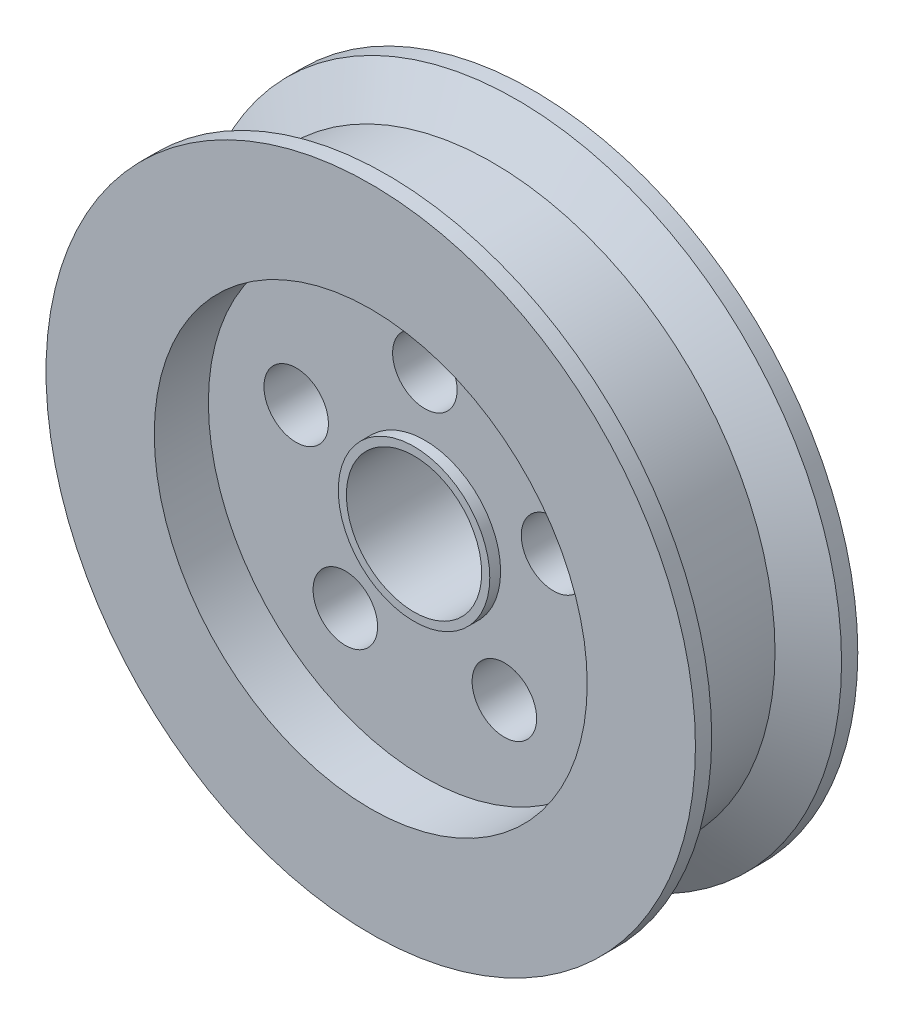
ISO-10303-21;
HEADER;
FILE_DESCRIPTION(('STEP AP214'),'2;1');
FILE_NAME('part.step','',(''),(''),'','','');
FILE_SCHEMA(('AUTOMOTIVE_DESIGN { 1 0 10303 214 1 1 1 1 }'));
ENDSEC;
DATA;
#1=APPLICATION_CONTEXT('core data for automotive mechanical design processes');
#2=APPLICATION_PROTOCOL_DEFINITION('international standard','automotive_design',2000,#1);
#3=PRODUCT_CONTEXT('',#1,'mechanical');
#4=PRODUCT('Part','Part','',(#3));
#5=PRODUCT_RELATED_PRODUCT_CATEGORY('part','',(#4));
#6=PRODUCT_DEFINITION_FORMATION('','',#4);
#7=PRODUCT_DEFINITION_CONTEXT('part definition',#1,'design');
#8=PRODUCT_DEFINITION('design','',#6,#7);
#9=PRODUCT_DEFINITION_SHAPE('','',#8);
#10=(LENGTH_UNIT() NAMED_UNIT(*) SI_UNIT(.MILLI.,.METRE.));
#11=(NAMED_UNIT(*) PLANE_ANGLE_UNIT() SI_UNIT($,.RADIAN.));
#12=(NAMED_UNIT(*) SI_UNIT($,.STERADIAN.) SOLID_ANGLE_UNIT());
#13=UNCERTAINTY_MEASURE_WITH_UNIT(LENGTH_MEASURE(1.E-05),#10,'distance_accuracy_value','');
#14=(GEOMETRIC_REPRESENTATION_CONTEXT(3) GLOBAL_UNCERTAINTY_ASSIGNED_CONTEXT((#13)) GLOBAL_UNIT_ASSIGNED_CONTEXT((#10,
#11,#12)) REPRESENTATION_CONTEXT('',''));
#15=CARTESIAN_POINT('',(0.,0.,0.));
#16=DIRECTION('',(0.,0.,1.));
#17=DIRECTION('',(1.,0.,0.));
#18=AXIS2_PLACEMENT_3D('',#15,#16,#17);
#19=CARTESIAN_POINT('',(0.,0.,30.));
#20=DIRECTION('',(0.,0.,-1.));
#21=DIRECTION('',(-1.,0.,0.));
#22=AXIS2_PLACEMENT_3D('',#19,#20,#21);
#23=CYLINDRICAL_SURFACE('',#22,60.);
#24=CARTESIAN_POINT('',(0.,0.,3.));
#25=DIRECTION('',(0.,0.,1.));
#26=DIRECTION('',(1.,0.,0.));
#27=AXIS2_PLACEMENT_3D('',#24,#25,#26);
#28=CIRCLE('',#27,60.);
#29=CARTESIAN_POINT('',(60.,0.,3.));
#30=VERTEX_POINT('',#29);
#31=EDGE_CURVE('E70',#30,#30,#28,.T.);
#32=ORIENTED_EDGE('',*,*,#31,.F.);
#33=EDGE_LOOP('',(#32));
#34=FACE_BOUND('',#33,.T.);
#35=CARTESIAN_POINT('',(0.,0.,0.));
#36=DIRECTION('',(0.,0.,1.));
#37=DIRECTION('',(1.,0.,0.));
#38=AXIS2_PLACEMENT_3D('',#35,#36,#37);
#39=CIRCLE('',#38,60.);
#40=CARTESIAN_POINT('',(60.,0.,0.));
#41=VERTEX_POINT('',#40);
#42=EDGE_CURVE('E50',#41,#41,#39,.T.);
#43=ORIENTED_EDGE('',*,*,#42,.T.);
#44=EDGE_LOOP('',(#43));
#45=FACE_BOUND('',#44,.T.);
#46=ADVANCED_FACE('F39',(#34,#45),#23,.T.);
#47=CARTESIAN_POINT('',(0.,0.,30.));
#48=DIRECTION('',(0.,0.,-1.));
#49=DIRECTION('',(-1.,0.,0.));
#50=AXIS2_PLACEMENT_3D('',#47,#48,#49);
#51=CYLINDRICAL_SURFACE('',#50,12.5);
#52=CARTESIAN_POINT('',(0.,0.,22.));
#53=DIRECTION('',(0.,0.,1.));
#54=DIRECTION('',(1.,0.,0.));
#55=AXIS2_PLACEMENT_3D('',#52,#53,#54);
#56=CIRCLE('',#55,12.5);
#57=CARTESIAN_POINT('',(12.5,0.,22.));
#58=VERTEX_POINT('',#57);
#59=EDGE_CURVE('E110',#58,#58,#56,.F.);
#60=ORIENTED_EDGE('',*,*,#59,.F.);
#61=EDGE_LOOP('',(#60));
#62=FACE_BOUND('',#61,.T.);
#63=CARTESIAN_POINT('',(0.,0.,0.));
#64=DIRECTION('',(0.,0.,1.));
#65=DIRECTION('',(1.,0.,0.));
#66=AXIS2_PLACEMENT_3D('',#63,#64,#65);
#67=CIRCLE('',#66,12.5);
#68=CARTESIAN_POINT('',(12.5,0.,0.));
#69=VERTEX_POINT('',#68);
#70=EDGE_CURVE('E55',#69,#69,#67,.T.);
#71=ORIENTED_EDGE('',*,*,#70,.F.);
#72=EDGE_LOOP('',(#71));
#73=FACE_BOUND('',#72,.T.);
#74=ADVANCED_FACE('F117',(#62,#73),#51,.F.);
#75=CARTESIAN_POINT('',(0.,0.,30.));
#76=DIRECTION('',(0.,0.,1.));
#77=DIRECTION('',(1.,0.,0.));
#78=AXIS2_PLACEMENT_3D('',#75,#76,#77);
#79=PLANE('',#78);
#80=CARTESIAN_POINT('',(0.,0.,30.));
#81=DIRECTION('',(0.,0.,1.));
#82=DIRECTION('',(1.,0.,0.));
#83=AXIS2_PLACEMENT_3D('',#80,#81,#82);
#84=CIRCLE('',#83,40.);
#85=CARTESIAN_POINT('',(40.,0.,30.));
#86=VERTEX_POINT('',#85);
#87=EDGE_CURVE('E60',#86,#86,#84,.T.);
#88=ORIENTED_EDGE('',*,*,#87,.F.);
#89=EDGE_LOOP('',(#88));
#90=FACE_BOUND('',#89,.T.);
#91=CARTESIAN_POINT('',(0.,0.,30.));
#92=DIRECTION('',(0.,0.,1.));
#93=DIRECTION('',(1.,0.,0.));
#94=AXIS2_PLACEMENT_3D('',#91,#92,#93);
#95=CIRCLE('',#94,60.);
#96=CARTESIAN_POINT('',(60.,0.,30.));
#97=VERTEX_POINT('',#96);
#98=EDGE_CURVE('E46',#97,#97,#95,.T.);
#99=ORIENTED_EDGE('',*,*,#98,.T.);
#100=EDGE_LOOP('',(#99));
#101=FACE_BOUND('',#100,.T.);
#102=ADVANCED_FACE('F120',(#90,#101),#79,.T.);
#103=CARTESIAN_POINT('',(0.,0.,0.));
#104=DIRECTION('',(0.,0.,1.));
#105=DIRECTION('',(1.,0.,0.));
#106=AXIS2_PLACEMENT_3D('',#103,#104,#105);
#107=PLANE('',#106);
#108=CARTESIAN_POINT('',(0.,25.,0.));
#109=DIRECTION('',(0.,0.,1.));
#110=DIRECTION('',(1.,0.,0.));
#111=AXIS2_PLACEMENT_3D('',#108,#109,#110);
#112=CIRCLE('',#111,5.95909830276263);
#113=CARTESIAN_POINT('',(5.95909830276263,25.,0.));
#114=VERTEX_POINT('',#113);
#115=EDGE_CURVE('E63',#114,#114,#112,.T.);
#116=ORIENTED_EDGE('',*,*,#115,.T.);
#117=EDGE_LOOP('',(#116));
#118=FACE_BOUND('',#117,.T.);
#119=CARTESIAN_POINT('',(23.7764129073796,7.7254248593747,0.));
#120=DIRECTION('',(0.,0.,1.));
#121=DIRECTION('',(1.,0.,0.));
#122=AXIS2_PLACEMENT_3D('',#119,#120,#121);
#123=CIRCLE('',#122,5.95909830276311);
#124=CARTESIAN_POINT('',(29.7355112101427,7.7254248593747,0.));
#125=VERTEX_POINT('',#124);
#126=EDGE_CURVE('E88',#125,#125,#123,.T.);
#127=ORIENTED_EDGE('',*,*,#126,.T.);
#128=EDGE_LOOP('',(#127));
#129=FACE_BOUND('',#128,.T.);
#130=CARTESIAN_POINT('',(14.6946313073137,-20.2254248593731,0.));
#131=DIRECTION('',(0.,0.,1.));
#132=DIRECTION('',(1.,0.,0.));
#133=AXIS2_PLACEMENT_3D('',#130,#131,#132);
#134=CIRCLE('',#133,5.95909830276442);
#135=CARTESIAN_POINT('',(20.6537296100782,-20.2254248593731,0.));
#136=VERTEX_POINT('',#135);
#137=EDGE_CURVE('E82',#136,#136,#134,.T.);
#138=ORIENTED_EDGE('',*,*,#137,.T.);
#139=EDGE_LOOP('',(#138));
#140=FACE_BOUND('',#139,.T.);
#141=CARTESIAN_POINT('',(-14.6946313073099,-20.2254248593743,0.));
#142=DIRECTION('',(0.,0.,1.));
#143=DIRECTION('',(1.,0.,0.));
#144=AXIS2_PLACEMENT_3D('',#141,#142,#143);
#145=CIRCLE('',#144,5.95909830276486);
#146=CARTESIAN_POINT('',(-8.73553300454505,-20.2254248593743,0.));
#147=VERTEX_POINT('',#146);
#148=EDGE_CURVE('E76',#147,#147,#145,.T.);
#149=ORIENTED_EDGE('',*,*,#148,.T.);
#150=EDGE_LOOP('',(#149));
#151=FACE_BOUND('',#150,.T.);
#152=CARTESIAN_POINT('',(-23.7764129073781,7.72542485937267,0.));
#153=DIRECTION('',(0.,0.,1.));
#154=DIRECTION('',(1.,0.,0.));
#155=AXIS2_PLACEMENT_3D('',#152,#153,#154);
#156=CIRCLE('',#155,5.95909830276391);
#157=CARTESIAN_POINT('',(-17.8173146046142,7.72542485937267,0.));
#158=VERTEX_POINT('',#157);
#159=EDGE_CURVE('E69',#158,#158,#156,.T.);
#160=ORIENTED_EDGE('',*,*,#159,.T.);
#161=EDGE_LOOP('',(#160));
#162=FACE_BOUND('',#161,.T.);
#163=ORIENTED_EDGE('',*,*,#42,.F.);
#164=EDGE_LOOP('',(#163));
#165=FACE_BOUND('',#164,.T.);
#166=ORIENTED_EDGE('',*,*,#70,.T.);
#167=EDGE_LOOP('',(#166));
#168=FACE_BOUND('',#167,.T.);
#169=ADVANCED_FACE('F124',(#118,#129,#140,#151,#162,#165,#168),#107,.F.);
#170=CARTESIAN_POINT('',(0.,0.,27.));
#171=DIRECTION('',(0.,0.,1.));
#172=DIRECTION('',(1.,0.,0.));
#173=AXIS2_PLACEMENT_3D('',#170,#171,#172);
#174=CIRCLE('',#173,60.);
#175=CARTESIAN_POINT('',(60.,0.,27.));
#176=VERTEX_POINT('',#175);
#177=EDGE_CURVE('E104',#176,#176,#174,.T.);
#178=ORIENTED_EDGE('',*,*,#177,.T.);
#179=EDGE_LOOP('',(#178));
#180=FACE_BOUND('',#179,.T.);
#181=ORIENTED_EDGE('',*,*,#98,.F.);
#182=EDGE_LOOP('',(#181));
#183=FACE_BOUND('',#182,.T.);
#184=ADVANCED_FACE('F41',(#180,#183),#23,.T.);
#185=CARTESIAN_POINT('',(0.,0.,20.));
#186=DIRECTION('',(0.,0.,1.));
#187=DIRECTION('',(1.,0.,0.));
#188=AXIS2_PLACEMENT_3D('',#185,#186,#187);
#189=CYLINDRICAL_SURFACE('',#188,40.);
#190=CARTESIAN_POINT('',(0.,0.,20.));
#191=DIRECTION('',(0.,0.,1.));
#192=DIRECTION('',(1.,0.,0.));
#193=AXIS2_PLACEMENT_3D('',#190,#191,#192);
#194=CIRCLE('',#193,40.);
#195=CARTESIAN_POINT('',(40.,0.,20.));
#196=VERTEX_POINT('',#195);
#197=EDGE_CURVE('E59',#196,#196,#194,.T.);
#198=ORIENTED_EDGE('',*,*,#197,.F.);
#199=EDGE_LOOP('',(#198));
#200=FACE_BOUND('',#199,.T.);
#201=ORIENTED_EDGE('',*,*,#87,.T.);
#202=EDGE_LOOP('',(#201));
#203=FACE_BOUND('',#202,.T.);
#204=ADVANCED_FACE('F131',(#200,#203),#189,.F.);
#205=CARTESIAN_POINT('',(0.,0.,20.));
#206=DIRECTION('',(0.,0.,1.));
#207=DIRECTION('',(1.,0.,0.));
#208=AXIS2_PLACEMENT_3D('',#205,#206,#207);
#209=PLANE('',#208);
#210=CARTESIAN_POINT('',(0.,0.,20.));
#211=DIRECTION('',(0.,0.,1.));
#212=DIRECTION('',(1.,0.,0.));
#213=AXIS2_PLACEMENT_3D('',#210,#211,#212);
#214=CIRCLE('',#213,14.);
#215=CARTESIAN_POINT('',(14.,0.,20.));
#216=VERTEX_POINT('',#215);
#217=EDGE_CURVE('E10',#216,#216,#214,.T.);
#218=ORIENTED_EDGE('',*,*,#217,.F.);
#219=EDGE_LOOP('',(#218));
#220=FACE_BOUND('',#219,.T.);
#221=CARTESIAN_POINT('',(0.,25.,20.));
#222=DIRECTION('',(0.,0.,1.));
#223=DIRECTION('',(1.,0.,0.));
#224=AXIS2_PLACEMENT_3D('',#221,#222,#223);
#225=CIRCLE('',#224,5.95909830276263);
#226=CARTESIAN_POINT('',(5.95909830276263,25.,20.));
#227=VERTEX_POINT('',#226);
#228=EDGE_CURVE('E91',#227,#227,#225,.T.);
#229=ORIENTED_EDGE('',*,*,#228,.F.);
#230=EDGE_LOOP('',(#229));
#231=FACE_BOUND('',#230,.T.);
#232=CARTESIAN_POINT('',(23.7764129073796,7.7254248593747,20.));
#233=DIRECTION('',(0.,0.,1.));
#234=DIRECTION('',(1.,0.,0.));
#235=AXIS2_PLACEMENT_3D('',#232,#233,#234);
#236=CIRCLE('',#235,5.95909830276311);
#237=CARTESIAN_POINT('',(29.7355112101427,7.7254248593747,20.));
#238=VERTEX_POINT('',#237);
#239=EDGE_CURVE('E85',#238,#238,#236,.T.);
#240=ORIENTED_EDGE('',*,*,#239,.F.);
#241=EDGE_LOOP('',(#240));
#242=FACE_BOUND('',#241,.T.);
#243=CARTESIAN_POINT('',(14.6946313073137,-20.2254248593731,20.));
#244=DIRECTION('',(0.,0.,1.));
#245=DIRECTION('',(1.,0.,0.));
#246=AXIS2_PLACEMENT_3D('',#243,#244,#245);
#247=CIRCLE('',#246,5.95909830276442);
#248=CARTESIAN_POINT('',(20.6537296100782,-20.2254248593731,20.));
#249=VERTEX_POINT('',#248);
#250=EDGE_CURVE('E79',#249,#249,#247,.T.);
#251=ORIENTED_EDGE('',*,*,#250,.F.);
#252=EDGE_LOOP('',(#251));
#253=FACE_BOUND('',#252,.T.);
#254=CARTESIAN_POINT('',(-14.6946313073099,-20.2254248593743,20.));
#255=DIRECTION('',(0.,0.,1.));
#256=DIRECTION('',(1.,0.,0.));
#257=AXIS2_PLACEMENT_3D('',#254,#255,#256);
#258=CIRCLE('',#257,5.95909830276486);
#259=CARTESIAN_POINT('',(-8.73553300454505,-20.2254248593743,20.));
#260=VERTEX_POINT('',#259);
#261=EDGE_CURVE('E73',#260,#260,#258,.T.);
#262=ORIENTED_EDGE('',*,*,#261,.F.);
#263=EDGE_LOOP('',(#262));
#264=FACE_BOUND('',#263,.T.);
#265=CARTESIAN_POINT('',(-23.7764129073781,7.72542485937267,20.));
#266=DIRECTION('',(0.,0.,1.));
#267=DIRECTION('',(1.,0.,0.));
#268=AXIS2_PLACEMENT_3D('',#265,#266,#267);
#269=CIRCLE('',#268,5.95909830276391);
#270=CARTESIAN_POINT('',(-17.8173146046142,7.72542485937267,20.));
#271=VERTEX_POINT('',#270);
#272=EDGE_CURVE('E66',#271,#271,#269,.T.);
#273=ORIENTED_EDGE('',*,*,#272,.F.);
#274=EDGE_LOOP('',(#273));
#275=FACE_BOUND('',#274,.T.);
#276=ORIENTED_EDGE('',*,*,#197,.T.);
#277=EDGE_LOOP('',(#276));
#278=FACE_BOUND('',#277,.T.);
#279=ADVANCED_FACE('F178',(#220,#231,#242,#253,#264,#275,#278),#209,.T.);
#280=CARTESIAN_POINT('',(-23.7764129073781,7.72542485937267,0.));
#281=DIRECTION('',(0.,0.,1.));
#282=DIRECTION('',(1.,0.,0.));
#283=AXIS2_PLACEMENT_3D('',#280,#281,#282);
#284=CYLINDRICAL_SURFACE('',#283,5.95909830276391);
#285=ORIENTED_EDGE('',*,*,#159,.F.);
#286=EDGE_LOOP('',(#285));
#287=FACE_BOUND('',#286,.T.);
#288=ORIENTED_EDGE('',*,*,#272,.T.);
#289=EDGE_LOOP('',(#288));
#290=FACE_BOUND('',#289,.T.);
#291=ADVANCED_FACE('F174',(#287,#290),#284,.F.);
#292=CARTESIAN_POINT('',(-14.6946313073099,-20.2254248593743,0.));
#293=DIRECTION('',(0.,0.,1.));
#294=DIRECTION('',(1.,0.,0.));
#295=AXIS2_PLACEMENT_3D('',#292,#293,#294);
#296=CYLINDRICAL_SURFACE('',#295,5.95909830276486);
#297=ORIENTED_EDGE('',*,*,#148,.F.);
#298=EDGE_LOOP('',(#297));
#299=FACE_BOUND('',#298,.T.);
#300=ORIENTED_EDGE('',*,*,#261,.T.);
#301=EDGE_LOOP('',(#300));
#302=FACE_BOUND('',#301,.T.);
#303=ADVANCED_FACE('F170',(#299,#302),#296,.F.);
#304=CARTESIAN_POINT('',(14.6946313073137,-20.2254248593731,0.));
#305=DIRECTION('',(0.,0.,1.));
#306=DIRECTION('',(1.,0.,0.));
#307=AXIS2_PLACEMENT_3D('',#304,#305,#306);
#308=CYLINDRICAL_SURFACE('',#307,5.95909830276442);
#309=ORIENTED_EDGE('',*,*,#137,.F.);
#310=EDGE_LOOP('',(#309));
#311=FACE_BOUND('',#310,.T.);
#312=ORIENTED_EDGE('',*,*,#250,.T.);
#313=EDGE_LOOP('',(#312));
#314=FACE_BOUND('',#313,.T.);
#315=ADVANCED_FACE('F166',(#311,#314),#308,.F.);
#316=CARTESIAN_POINT('',(23.7764129073796,7.7254248593747,0.));
#317=DIRECTION('',(0.,0.,1.));
#318=DIRECTION('',(1.,0.,0.));
#319=AXIS2_PLACEMENT_3D('',#316,#317,#318);
#320=CYLINDRICAL_SURFACE('',#319,5.95909830276311);
#321=ORIENTED_EDGE('',*,*,#126,.F.);
#322=EDGE_LOOP('',(#321));
#323=FACE_BOUND('',#322,.T.);
#324=ORIENTED_EDGE('',*,*,#239,.T.);
#325=EDGE_LOOP('',(#324));
#326=FACE_BOUND('',#325,.T.);
#327=ADVANCED_FACE('F158',(#323,#326),#320,.F.);
#328=CARTESIAN_POINT('',(0.,25.,0.));
#329=DIRECTION('',(0.,0.,1.));
#330=DIRECTION('',(1.,0.,0.));
#331=AXIS2_PLACEMENT_3D('',#328,#329,#330);
#332=CYLINDRICAL_SURFACE('',#331,5.95909830276263);
#333=ORIENTED_EDGE('',*,*,#115,.F.);
#334=EDGE_LOOP('',(#333));
#335=FACE_BOUND('',#334,.T.);
#336=ORIENTED_EDGE('',*,*,#228,.T.);
#337=EDGE_LOOP('',(#336));
#338=FACE_BOUND('',#337,.T.);
#339=ADVANCED_FACE('F148',(#335,#338),#332,.F.);
#340=CARTESIAN_POINT('',(0.,0.,3.));
#341=DIRECTION('',(0.,0.,-1.));
#342=DIRECTION('',(-1.,0.,0.));
#343=AXIS2_PLACEMENT_3D('',#340,#341,#342);
#344=CONICAL_SURFACE('',#343,60.,1.04719755119659);
#345=CARTESIAN_POINT('',(0.,0.,7.5));
#346=DIRECTION('',(0.,0.,1.));
#347=DIRECTION('',(1.,0.,0.));
#348=AXIS2_PLACEMENT_3D('',#345,#346,#347);
#349=CIRCLE('',#348,52.2057713659401);
#350=CARTESIAN_POINT('',(52.2057713659401,0.,7.5));
#351=VERTEX_POINT('',#350);
#352=EDGE_CURVE('E98',#351,#351,#349,.T.);
#353=ORIENTED_EDGE('',*,*,#352,.F.);
#354=EDGE_LOOP('',(#353));
#355=FACE_BOUND('',#354,.T.);
#356=ORIENTED_EDGE('',*,*,#31,.T.);
#357=EDGE_LOOP('',(#356));
#358=FACE_BOUND('',#357,.T.);
#359=ADVANCED_FACE('F145',(#355,#358),#344,.T.);
#360=CARTESIAN_POINT('',(0.,0.,0.));
#361=DIRECTION('',(0.,0.,1.));
#362=DIRECTION('',(1.,0.,0.));
#363=AXIS2_PLACEMENT_3D('',#360,#361,#362);
#364=CYLINDRICAL_SURFACE('',#363,52.2057713659402);
#365=CARTESIAN_POINT('',(0.,0.,22.5));
#366=DIRECTION('',(0.,0.,1.));
#367=DIRECTION('',(1.,0.,0.));
#368=AXIS2_PLACEMENT_3D('',#365,#366,#367);
#369=CIRCLE('',#368,52.2057713659402);
#370=CARTESIAN_POINT('',(52.2057713659402,0.,22.5));
#371=VERTEX_POINT('',#370);
#372=EDGE_CURVE('E101',#371,#371,#369,.T.);
#373=ORIENTED_EDGE('',*,*,#372,.F.);
#374=EDGE_LOOP('',(#373));
#375=FACE_BOUND('',#374,.T.);
#376=ORIENTED_EDGE('',*,*,#352,.T.);
#377=EDGE_LOOP('',(#376));
#378=FACE_BOUND('',#377,.T.);
#379=ADVANCED_FACE('F147',(#375,#378),#364,.T.);
#380=CARTESIAN_POINT('',(0.,0.,22.5));
#381=DIRECTION('',(0.,0.,1.));
#382=DIRECTION('',(1.,0.,0.));
#383=AXIS2_PLACEMENT_3D('',#380,#381,#382);
#384=CONICAL_SURFACE('',#383,52.2057713659402,1.04719755119659);
#385=ORIENTED_EDGE('',*,*,#177,.F.);
#386=EDGE_LOOP('',(#385));
#387=FACE_BOUND('',#386,.T.);
#388=ORIENTED_EDGE('',*,*,#372,.T.);
#389=EDGE_LOOP('',(#388));
#390=FACE_BOUND('',#389,.T.);
#391=ADVANCED_FACE('F155',(#387,#390),#384,.T.);
#392=CARTESIAN_POINT('',(0.,0.,13.));
#393=DIRECTION('',(0.,0.,1.));
#394=DIRECTION('',(1.,0.,0.));
#395=AXIS2_PLACEMENT_3D('',#392,#393,#394);
#396=CYLINDRICAL_SURFACE('',#395,14.);
#397=ORIENTED_EDGE('',*,*,#217,.T.);
#398=EDGE_LOOP('',(#397));
#399=FACE_BOUND('',#398,.T.);
#400=CARTESIAN_POINT('',(0.,0.,22.));
#401=DIRECTION('',(0.,0.,1.));
#402=DIRECTION('',(1.,0.,0.));
#403=AXIS2_PLACEMENT_3D('',#400,#401,#402);
#404=CIRCLE('',#403,14.);
#405=CARTESIAN_POINT('',(14.,0.,22.));
#406=VERTEX_POINT('',#405);
#407=EDGE_CURVE('E107',#406,#406,#404,.T.);
#408=ORIENTED_EDGE('',*,*,#407,.F.);
#409=EDGE_LOOP('',(#408));
#410=FACE_BOUND('',#409,.T.);
#411=ADVANCED_FACE('F285',(#399,#410),#396,.T.);
#412=CARTESIAN_POINT('',(0.,0.,22.));
#413=DIRECTION('',(0.,0.,1.));
#414=DIRECTION('',(1.,0.,0.));
#415=AXIS2_PLACEMENT_3D('',#412,#413,#414);
#416=PLANE('',#415);
#417=ORIENTED_EDGE('',*,*,#59,.T.);
#418=EDGE_LOOP('',(#417));
#419=FACE_BOUND('',#418,.T.);
#420=ORIENTED_EDGE('',*,*,#407,.T.);
#421=EDGE_LOOP('',(#420));
#422=FACE_BOUND('',#421,.T.);
#423=ADVANCED_FACE('F114',(#419,#422),#416,.T.);
#424=CLOSED_SHELL('',(#46,#74,#102,#169,#184,#204,#279,#291,#303,#315,#327,#339,#359,#379,#391,
#411,#423));
#425=MANIFOLD_SOLID_BREP('B2',#424);
#426=ADVANCED_BREP_SHAPE_REPRESENTATION('',(#18,#425),#14);
#427=SHAPE_DEFINITION_REPRESENTATION(#9,#426);
ENDSEC;
END-ISO-10303-21;
